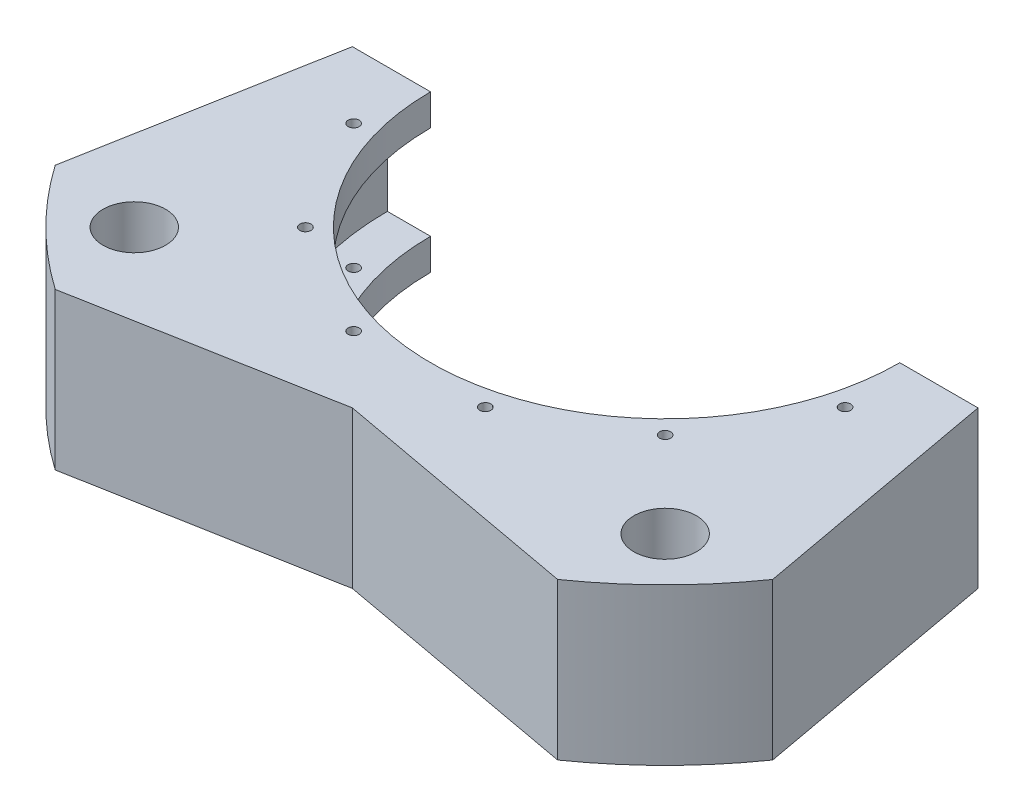
ISO-10303-21;
HEADER;
FILE_DESCRIPTION(('STEP AP214'),'2;1');
FILE_NAME('part.step','',(''),(''),'','','');
FILE_SCHEMA(('AUTOMOTIVE_DESIGN { 1 0 10303 214 1 1 1 1 }'));
ENDSEC;
DATA;
#1=APPLICATION_CONTEXT('core data for automotive mechanical design processes');
#2=APPLICATION_PROTOCOL_DEFINITION('international standard','automotive_design',2000,#1);
#3=PRODUCT_CONTEXT('',#1,'mechanical');
#4=PRODUCT('Part','Part','',(#3));
#5=PRODUCT_RELATED_PRODUCT_CATEGORY('part','',(#4));
#6=PRODUCT_DEFINITION_FORMATION('','',#4);
#7=PRODUCT_DEFINITION_CONTEXT('part definition',#1,'design');
#8=PRODUCT_DEFINITION('design','',#6,#7);
#9=PRODUCT_DEFINITION_SHAPE('','',#8);
#10=(LENGTH_UNIT() NAMED_UNIT(*) SI_UNIT(.MILLI.,.METRE.));
#11=(NAMED_UNIT(*) PLANE_ANGLE_UNIT() SI_UNIT($,.RADIAN.));
#12=(NAMED_UNIT(*) SI_UNIT($,.STERADIAN.) SOLID_ANGLE_UNIT());
#13=UNCERTAINTY_MEASURE_WITH_UNIT(LENGTH_MEASURE(1.E-05),#10,'distance_accuracy_value','');
#14=(GEOMETRIC_REPRESENTATION_CONTEXT(3) GLOBAL_UNCERTAINTY_ASSIGNED_CONTEXT((#13)) GLOBAL_UNIT_ASSIGNED_CONTEXT((#10,
#11,#12)) REPRESENTATION_CONTEXT('',''));
#15=CARTESIAN_POINT('',(0.,0.,0.));
#16=DIRECTION('',(0.,0.,1.));
#17=DIRECTION('',(1.,0.,0.));
#18=AXIS2_PLACEMENT_3D('',#15,#16,#17);
#19=CARTESIAN_POINT('',(0.,22.5392867230028,0.));
#20=DIRECTION('',(0.,1.,0.));
#21=DIRECTION('',(0.,0.,1.));
#22=AXIS2_PLACEMENT_3D('',#19,#20,#21);
#23=CYLINDRICAL_SURFACE('',#22,88.9);
#24=CARTESIAN_POINT('',(0.,15.875,0.));
#25=DIRECTION('',(0.,1.,0.));
#26=DIRECTION('',(0.,0.,1.));
#27=AXIS2_PLACEMENT_3D('',#24,#25,#26);
#28=CIRCLE('',#27,88.9);
#29=CARTESIAN_POINT('',(50.9909451916081,15.875,72.8226167372913));
#30=VERTEX_POINT('',#29);
#31=CARTESIAN_POINT('',(72.8226167372913,15.875,50.9909451916081));
#32=VERTEX_POINT('',#31);
#33=EDGE_CURVE('E159',#30,#32,#28,.T.);
#34=ORIENTED_EDGE('',*,*,#33,.F.);
#35=DIRECTION('',(0.,1.,0.));
#36=VECTOR('',#35,1.);
#37=CARTESIAN_POINT('',(50.9909451916081,-15.876,72.8226167372913));
#38=LINE('',#37,#36);
#39=CARTESIAN_POINT('',(50.9909451916081,-15.875,72.8226167372913));
#40=VERTEX_POINT('',#39);
#41=EDGE_CURVE('E154',#40,#30,#38,.T.);
#42=ORIENTED_EDGE('',*,*,#41,.F.);
#43=CARTESIAN_POINT('',(0.,-15.875,0.));
#44=DIRECTION('',(0.,1.,0.));
#45=DIRECTION('',(0.,0.,1.));
#46=AXIS2_PLACEMENT_3D('',#43,#44,#45);
#47=CIRCLE('',#46,88.9);
#48=CARTESIAN_POINT('',(72.8226167372913,-15.875,50.9909451916081));
#49=VERTEX_POINT('',#48);
#50=EDGE_CURVE('E148',#40,#49,#47,.T.);
#51=ORIENTED_EDGE('',*,*,#50,.T.);
#52=DIRECTION('',(0.,1.,0.));
#53=VECTOR('',#52,1.);
#54=CARTESIAN_POINT('',(72.8226167372913,-15.876,50.9909451916081));
#55=LINE('',#54,#53);
#56=EDGE_CURVE('E130',#49,#32,#55,.T.);
#57=ORIENTED_EDGE('',*,*,#56,.T.);
#58=EDGE_LOOP('',(#34,#42,#51,#57));
#59=FACE_BOUND('',#58,.T.);
#60=ADVANCED_FACE('F33',(#59),#23,.T.);
#61=CARTESIAN_POINT('',(-72.8226167372913,-15.875,50.9909451916081));
#62=VERTEX_POINT('',#61);
#63=CARTESIAN_POINT('',(-50.9909451916081,-15.875,72.8226167372913));
#64=VERTEX_POINT('',#63);
#65=EDGE_CURVE('E155',#62,#64,#47,.T.);
#66=ORIENTED_EDGE('',*,*,#65,.T.);
#67=DIRECTION('',(0.,1.,0.));
#68=VECTOR('',#67,1.);
#69=CARTESIAN_POINT('',(-50.9909451916081,-15.876,72.8226167372913));
#70=LINE('',#69,#68);
#71=CARTESIAN_POINT('',(-50.9909451916081,15.875,72.8226167372913));
#72=VERTEX_POINT('',#71);
#73=EDGE_CURVE('E50',#64,#72,#70,.T.);
#74=ORIENTED_EDGE('',*,*,#73,.T.);
#75=CARTESIAN_POINT('',(-72.8226167372913,15.875,50.9909451916081));
#76=VERTEX_POINT('',#75);
#77=EDGE_CURVE('E165',#76,#72,#28,.T.);
#78=ORIENTED_EDGE('',*,*,#77,.F.);
#79=DIRECTION('',(0.,1.,0.));
#80=VECTOR('',#79,1.);
#81=CARTESIAN_POINT('',(-72.8226167372913,-15.876,50.9909451916081));
#82=LINE('',#81,#80);
#83=EDGE_CURVE('E293',#62,#76,#82,.T.);
#84=ORIENTED_EDGE('',*,*,#83,.F.);
#85=EDGE_LOOP('',(#66,#74,#78,#84));
#86=FACE_BOUND('',#85,.T.);
#87=ADVANCED_FACE('F350',(#86),#23,.T.);
#88=CARTESIAN_POINT('',(-47.625,15.875,-3.32563597524808E-13));
#89=DIRECTION('',(0.,-1.,0.));
#90=DIRECTION('',(0.,0.,-1.));
#91=AXIS2_PLACEMENT_3D('',#88,#89,#90);
#92=PLANE('',#91);
#93=CARTESIAN_POINT('',(-53.8815367264144,15.875,53.8815367264146));
#94=DIRECTION('',(0.,1.,0.));
#95=DIRECTION('',(0.,0.,1.));
#96=AXIS2_PLACEMENT_3D('',#93,#94,#95);
#97=CIRCLE('',#96,6.35000000000001);
#98=CARTESIAN_POINT('',(-53.8815367264144,15.875,60.2315367264146));
#99=VERTEX_POINT('',#98);
#100=EDGE_CURVE('E298',#99,#99,#97,.T.);
#101=ORIENTED_EDGE('',*,*,#100,.F.);
#102=EDGE_LOOP('',(#101));
#103=FACE_BOUND('',#102,.T.);
#104=CARTESIAN_POINT('',(49.8786710030803,15.875,13.3649496148126));
#105=DIRECTION('',(0.,1.,0.));
#106=DIRECTION('',(0.,0.,1.));
#107=AXIS2_PLACEMENT_3D('',#104,#105,#106);
#108=CIRCLE('',#107,1.13029999999999);
#109=CARTESIAN_POINT('',(49.8786710030803,15.875,14.4952496148126));
#110=VERTEX_POINT('',#109);
#111=EDGE_CURVE('E228',#110,#110,#108,.T.);
#112=ORIENTED_EDGE('',*,*,#111,.F.);
#113=EDGE_LOOP('',(#112));
#114=FACE_BOUND('',#113,.T.);
#115=CARTESIAN_POINT('',(-49.87867100308,15.875,13.3649496148137));
#116=DIRECTION('',(0.,1.,0.));
#117=DIRECTION('',(0.,0.,1.));
#118=AXIS2_PLACEMENT_3D('',#115,#116,#117);
#119=CIRCLE('',#118,1.13029999999999);
#120=CARTESIAN_POINT('',(-49.87867100308,15.875,14.4952496148137));
#121=VERTEX_POINT('',#120);
#122=EDGE_CURVE('E216',#121,#121,#119,.T.);
#123=ORIENTED_EDGE('',*,*,#122,.F.);
#124=EDGE_LOOP('',(#123));
#125=FACE_BOUND('',#124,.T.);
#126=CARTESIAN_POINT('',(-36.5137213882666,15.875,36.5137213882678));
#127=DIRECTION('',(0.,1.,0.));
#128=DIRECTION('',(0.,0.,1.));
#129=AXIS2_PLACEMENT_3D('',#126,#127,#128);
#130=CIRCLE('',#129,1.13029999999999);
#131=CARTESIAN_POINT('',(-36.5137213882666,15.875,37.6440213882678));
#132=VERTEX_POINT('',#131);
#133=EDGE_CURVE('E209',#132,#132,#130,.T.);
#134=ORIENTED_EDGE('',*,*,#133,.F.);
#135=EDGE_LOOP('',(#134));
#136=FACE_BOUND('',#135,.T.);
#137=CARTESIAN_POINT('',(-13.3649496148121,15.875,49.8786710030804));
#138=DIRECTION('',(0.,1.,0.));
#139=DIRECTION('',(0.,0.,1.));
#140=AXIS2_PLACEMENT_3D('',#137,#138,#139);
#141=CIRCLE('',#140,1.13029999999999);
#142=CARTESIAN_POINT('',(-13.3649496148121,15.875,51.0089710030804));
#143=VERTEX_POINT('',#142);
#144=EDGE_CURVE('E186',#143,#143,#141,.T.);
#145=ORIENTED_EDGE('',*,*,#144,.F.);
#146=EDGE_LOOP('',(#145));
#147=FACE_BOUND('',#146,.T.);
#148=CARTESIAN_POINT('',(13.3649496148139,15.875,49.8786710030799));
#149=DIRECTION('',(0.,1.,0.));
#150=DIRECTION('',(0.,0.,1.));
#151=AXIS2_PLACEMENT_3D('',#148,#149,#150);
#152=CIRCLE('',#151,1.13029999999999);
#153=CARTESIAN_POINT('',(13.3649496148139,15.875,51.0089710030799));
#154=VERTEX_POINT('',#153);
#155=EDGE_CURVE('E189',#154,#154,#152,.T.);
#156=ORIENTED_EDGE('',*,*,#155,.F.);
#157=EDGE_LOOP('',(#156));
#158=FACE_BOUND('',#157,.T.);
#159=CARTESIAN_POINT('',(36.5137213882679,15.875,36.5137213882665));
#160=DIRECTION('',(0.,1.,0.));
#161=DIRECTION('',(0.,0.,1.));
#162=AXIS2_PLACEMENT_3D('',#159,#160,#161);
#163=CIRCLE('',#162,1.13029999999999);
#164=CARTESIAN_POINT('',(36.5137213882679,15.875,37.6440213882664));
#165=VERTEX_POINT('',#164);
#166=EDGE_CURVE('E320',#165,#165,#163,.T.);
#167=ORIENTED_EDGE('',*,*,#166,.F.);
#168=EDGE_LOOP('',(#167));
#169=FACE_BOUND('',#168,.T.);
#170=CARTESIAN_POINT('',(53.8815367264152,15.875,53.8815367264146));
#171=DIRECTION('',(0.,1.,0.));
#172=DIRECTION('',(0.,0.,1.));
#173=AXIS2_PLACEMENT_3D('',#170,#171,#172);
#174=CIRCLE('',#173,6.35);
#175=CARTESIAN_POINT('',(53.8815367264152,15.875,60.2315367264146));
#176=VERTEX_POINT('',#175);
#177=EDGE_CURVE('E304',#176,#176,#174,.T.);
#178=ORIENTED_EDGE('',*,*,#177,.F.);
#179=EDGE_LOOP('',(#178));
#180=FACE_BOUND('',#179,.T.);
#181=DIRECTION('',(-0.983694459254473,0.,0.179847743472221));
#182=VECTOR('',#181,1.);
#183=CARTESIAN_POINT('',(11.2341170264533,15.875,61.4460791121649));
#184=LINE('',#183,#182);
#185=CARTESIAN_POINT('',(3.50414142147315E-13,15.875,63.5));
#186=VERTEX_POINT('',#185);
#187=EDGE_CURVE('E308',#186,#72,#184,.T.);
#188=ORIENTED_EDGE('',*,*,#187,.F.);
#189=DIRECTION('',(-0.983694459254473,0.,-0.179847743472223));
#190=VECTOR('',#189,1.);
#191=CARTESIAN_POINT('',(-11.2341170264534,15.875,61.4460791121647));
#192=LINE('',#191,#190);
#193=EDGE_CURVE('E288',#30,#186,#192,.T.);
#194=ORIENTED_EDGE('',*,*,#193,.F.);
#195=ORIENTED_EDGE('',*,*,#33,.T.);
#196=DIRECTION('',(-0.17984774347222,0.,-0.983694459254473));
#197=VECTOR('',#196,1.);
#198=CARTESIAN_POINT('',(61.446079112165,15.875,-11.2341170264532));
#199=LINE('',#198,#197);
#200=CARTESIAN_POINT('',(63.5000000000001,15.875,0.));
#201=VERTEX_POINT('',#200);
#202=EDGE_CURVE('E136',#32,#201,#199,.T.);
#203=ORIENTED_EDGE('',*,*,#202,.T.);
#204=DIRECTION('',(-1.,0.,0.));
#205=VECTOR('',#204,1.);
#206=CARTESIAN_POINT('',(47.625,15.875,0.));
#207=LINE('',#206,#205);
#208=CARTESIAN_POINT('',(47.625,15.875,0.));
#209=VERTEX_POINT('',#208);
#210=EDGE_CURVE('E245',#201,#209,#207,.T.);
#211=ORIENTED_EDGE('',*,*,#210,.T.);
#212=CARTESIAN_POINT('',(0.,15.875,0.));
#213=DIRECTION('',(0.,1.,0.));
#214=DIRECTION('',(0.,0.,1.));
#215=AXIS2_PLACEMENT_3D('',#212,#213,#214);
#216=CIRCLE('',#215,47.625);
#217=CARTESIAN_POINT('',(-47.625,15.875,-3.32563597524808E-13));
#218=VERTEX_POINT('',#217);
#219=EDGE_CURVE('E166',#218,#209,#216,.T.);
#220=ORIENTED_EDGE('',*,*,#219,.F.);
#221=DIRECTION('',(1.,0.,0.));
#222=VECTOR('',#221,1.);
#223=CARTESIAN_POINT('',(-47.625,15.875,-3.32563597524808E-13));
#224=LINE('',#223,#222);
#225=CARTESIAN_POINT('',(-63.5,15.875,-4.43418130033078E-13));
#226=VERTEX_POINT('',#225);
#227=EDGE_CURVE('E265',#226,#218,#224,.T.);
#228=ORIENTED_EDGE('',*,*,#227,.F.);
#229=DIRECTION('',(0.179847743472219,0.,-0.983694459254473));
#230=VECTOR('',#229,1.);
#231=CARTESIAN_POINT('',(-61.446079112165,15.875,-11.2341170264532));
#232=LINE('',#231,#230);
#233=EDGE_CURVE('E58',#76,#226,#232,.T.);
#234=ORIENTED_EDGE('',*,*,#233,.F.);
#235=ORIENTED_EDGE('',*,*,#77,.T.);
#236=EDGE_LOOP('',(#188,#194,#195,#203,#211,#220,#228,#234,#235));
#237=FACE_BOUND('',#236,.T.);
#238=ADVANCED_FACE('F355',(#103,#114,#125,#136,#147,#158,#169,#180,#237),#92,.F.);
#239=CARTESIAN_POINT('',(-47.625,-15.875,-3.32563597524809E-13));
#240=DIRECTION('',(0.,1.,0.));
#241=DIRECTION('',(0.,0.,1.));
#242=AXIS2_PLACEMENT_3D('',#239,#240,#241);
#243=PLANE('',#242);
#244=CARTESIAN_POINT('',(-53.8815367264144,-15.875,53.8815367264146));
#245=DIRECTION('',(0.,1.,0.));
#246=DIRECTION('',(0.,0.,1.));
#247=AXIS2_PLACEMENT_3D('',#244,#245,#246);
#248=CIRCLE('',#247,6.35000000000001);
#249=CARTESIAN_POINT('',(-53.8815367264144,-15.875,60.2315367264146));
#250=VERTEX_POINT('',#249);
#251=EDGE_CURVE('E301',#250,#250,#248,.F.);
#252=ORIENTED_EDGE('',*,*,#251,.F.);
#253=EDGE_LOOP('',(#252));
#254=FACE_BOUND('',#253,.T.);
#255=CARTESIAN_POINT('',(49.8786710030803,-15.875,13.3649496148126));
#256=DIRECTION('',(0.,1.,0.));
#257=DIRECTION('',(0.,0.,1.));
#258=AXIS2_PLACEMENT_3D('',#255,#256,#257);
#259=CIRCLE('',#258,1.13029999999999);
#260=CARTESIAN_POINT('',(49.8786710030803,-15.875,14.4952496148126));
#261=VERTEX_POINT('',#260);
#262=EDGE_CURVE('E174',#261,#261,#259,.T.);
#263=ORIENTED_EDGE('',*,*,#262,.T.);
#264=EDGE_LOOP('',(#263));
#265=FACE_BOUND('',#264,.T.);
#266=CARTESIAN_POINT('',(-49.87867100308,-15.875,13.3649496148137));
#267=DIRECTION('',(0.,1.,0.));
#268=DIRECTION('',(0.,0.,1.));
#269=AXIS2_PLACEMENT_3D('',#266,#267,#268);
#270=CIRCLE('',#269,1.13029999999999);
#271=CARTESIAN_POINT('',(-49.87867100308,-15.875,14.4952496148137));
#272=VERTEX_POINT('',#271);
#273=EDGE_CURVE('E219',#272,#272,#270,.T.);
#274=ORIENTED_EDGE('',*,*,#273,.T.);
#275=EDGE_LOOP('',(#274));
#276=FACE_BOUND('',#275,.T.);
#277=CARTESIAN_POINT('',(-36.5137213882666,-15.875,36.5137213882678));
#278=DIRECTION('',(0.,1.,0.));
#279=DIRECTION('',(0.,0.,1.));
#280=AXIS2_PLACEMENT_3D('',#277,#278,#279);
#281=CIRCLE('',#280,1.13029999999999);
#282=CARTESIAN_POINT('',(-36.5137213882666,-15.875,37.6440213882678));
#283=VERTEX_POINT('',#282);
#284=EDGE_CURVE('E178',#283,#283,#281,.T.);
#285=ORIENTED_EDGE('',*,*,#284,.T.);
#286=EDGE_LOOP('',(#285));
#287=FACE_BOUND('',#286,.T.);
#288=CARTESIAN_POINT('',(-13.3649496148121,-15.875,49.8786710030804));
#289=DIRECTION('',(0.,1.,0.));
#290=DIRECTION('',(0.,0.,1.));
#291=AXIS2_PLACEMENT_3D('',#288,#289,#290);
#292=CIRCLE('',#291,1.1303);
#293=CARTESIAN_POINT('',(-13.3649496148121,-15.875,51.0089710030804));
#294=VERTEX_POINT('',#293);
#295=EDGE_CURVE('E200',#294,#294,#292,.T.);
#296=ORIENTED_EDGE('',*,*,#295,.T.);
#297=EDGE_LOOP('',(#296));
#298=FACE_BOUND('',#297,.T.);
#299=CARTESIAN_POINT('',(13.3649496148139,-15.875,49.8786710030799));
#300=DIRECTION('',(0.,1.,0.));
#301=DIRECTION('',(0.,0.,1.));
#302=AXIS2_PLACEMENT_3D('',#299,#300,#301);
#303=CIRCLE('',#302,1.1303);
#304=CARTESIAN_POINT('',(13.3649496148139,-15.875,51.0089710030799));
#305=VERTEX_POINT('',#304);
#306=EDGE_CURVE('E182',#305,#305,#303,.T.);
#307=ORIENTED_EDGE('',*,*,#306,.T.);
#308=EDGE_LOOP('',(#307));
#309=FACE_BOUND('',#308,.T.);
#310=CARTESIAN_POINT('',(36.5137213882679,-15.875,36.5137213882665));
#311=DIRECTION('',(0.,1.,0.));
#312=DIRECTION('',(0.,0.,1.));
#313=AXIS2_PLACEMENT_3D('',#310,#311,#312);
#314=CIRCLE('',#313,1.13029999999999);
#315=CARTESIAN_POINT('',(36.5137213882679,-15.875,37.6440213882665));
#316=VERTEX_POINT('',#315);
#317=EDGE_CURVE('E323',#316,#316,#314,.T.);
#318=ORIENTED_EDGE('',*,*,#317,.T.);
#319=EDGE_LOOP('',(#318));
#320=FACE_BOUND('',#319,.T.);
#321=CARTESIAN_POINT('',(53.8815367264152,-15.875,53.8815367264146));
#322=DIRECTION('',(0.,1.,0.));
#323=DIRECTION('',(0.,0.,1.));
#324=AXIS2_PLACEMENT_3D('',#321,#322,#323);
#325=CIRCLE('',#324,6.35);
#326=CARTESIAN_POINT('',(53.8815367264152,-15.875,60.2315367264146));
#327=VERTEX_POINT('',#326);
#328=EDGE_CURVE('E317',#327,#327,#325,.F.);
#329=ORIENTED_EDGE('',*,*,#328,.F.);
#330=EDGE_LOOP('',(#329));
#331=FACE_BOUND('',#330,.T.);
#332=ORIENTED_EDGE('',*,*,#50,.F.);
#333=DIRECTION('',(0.983694459254473,0.,0.179847743472223));
#334=VECTOR('',#333,1.);
#335=CARTESIAN_POINT('',(-11.2341170264534,-15.875,61.4460791121647));
#336=LINE('',#335,#334);
#337=CARTESIAN_POINT('',(3.50414142147315E-13,-15.875,63.5));
#338=VERTEX_POINT('',#337);
#339=EDGE_CURVE('E286',#338,#40,#336,.T.);
#340=ORIENTED_EDGE('',*,*,#339,.F.);
#341=DIRECTION('',(0.983694459254473,0.,-0.179847743472221));
#342=VECTOR('',#341,1.);
#343=CARTESIAN_POINT('',(11.2341170264533,-15.875,61.4460791121649));
#344=LINE('',#343,#342);
#345=EDGE_CURVE('E302',#64,#338,#344,.T.);
#346=ORIENTED_EDGE('',*,*,#345,.F.);
#347=ORIENTED_EDGE('',*,*,#65,.F.);
#348=DIRECTION('',(-0.179847743472219,0.,0.983694459254474));
#349=VECTOR('',#348,1.);
#350=CARTESIAN_POINT('',(-61.446079112165,-15.875,-11.2341170264532));
#351=LINE('',#350,#349);
#352=CARTESIAN_POINT('',(-63.5,-15.875,-4.42886308203582E-13));
#353=VERTEX_POINT('',#352);
#354=EDGE_CURVE('E151',#353,#62,#351,.T.);
#355=ORIENTED_EDGE('',*,*,#354,.F.);
#356=DIRECTION('',(-1.,0.,0.));
#357=VECTOR('',#356,1.);
#358=CARTESIAN_POINT('',(-47.625,-15.875,-3.32563597524809E-13));
#359=LINE('',#358,#357);
#360=CARTESIAN_POINT('',(-47.625,-15.875,-3.32563597524809E-13));
#361=VERTEX_POINT('',#360);
#362=EDGE_CURVE('E262',#361,#353,#359,.T.);
#363=ORIENTED_EDGE('',*,*,#362,.F.);
#364=CARTESIAN_POINT('',(0.,-15.875,0.));
#365=DIRECTION('',(0.,1.,0.));
#366=DIRECTION('',(0.,0.,1.));
#367=AXIS2_PLACEMENT_3D('',#364,#365,#366);
#368=CIRCLE('',#367,47.625);
#369=CARTESIAN_POINT('',(47.625,-15.875,0.));
#370=VERTEX_POINT('',#369);
#371=EDGE_CURVE('E156',#361,#370,#368,.T.);
#372=ORIENTED_EDGE('',*,*,#371,.T.);
#373=DIRECTION('',(1.,0.,0.));
#374=VECTOR('',#373,1.);
#375=CARTESIAN_POINT('',(47.625,-15.875,0.));
#376=LINE('',#375,#374);
#377=CARTESIAN_POINT('',(63.5000000000001,-15.875,0.));
#378=VERTEX_POINT('',#377);
#379=EDGE_CURVE('E150',#370,#378,#376,.T.);
#380=ORIENTED_EDGE('',*,*,#379,.T.);
#381=DIRECTION('',(0.17984774347222,0.,0.983694459254473));
#382=VECTOR('',#381,1.);
#383=CARTESIAN_POINT('',(61.446079112165,-15.875,-11.2341170264532));
#384=LINE('',#383,#382);
#385=EDGE_CURVE('E133',#378,#49,#384,.T.);
#386=ORIENTED_EDGE('',*,*,#385,.T.);
#387=EDGE_LOOP('',(#332,#340,#346,#347,#355,#363,#372,#380,#386));
#388=FACE_BOUND('',#387,.T.);
#389=ADVANCED_FACE('F146',(#254,#265,#276,#287,#298,#309,#320,#331,#388),#243,.F.);
#390=CARTESIAN_POINT('',(0.,0.,0.));
#391=DIRECTION('',(0.,0.,-1.));
#392=DIRECTION('',(-1.,0.,0.));
#393=AXIS2_PLACEMENT_3D('',#390,#391,#392);
#394=PLANE('',#393);
#395=ORIENTED_EDGE('',*,*,#210,.F.);
#396=DIRECTION('',(0.,1.,0.));
#397=VECTOR('',#396,1.);
#398=CARTESIAN_POINT('',(63.5000000000001,-15.876,0.));
#399=LINE('',#398,#397);
#400=EDGE_CURVE('E141',#378,#201,#399,.T.);
#401=ORIENTED_EDGE('',*,*,#400,.F.);
#402=ORIENTED_EDGE('',*,*,#379,.F.);
#403=DIRECTION('',(0.,-1.,0.));
#404=VECTOR('',#403,1.);
#405=CARTESIAN_POINT('',(47.625,-9.525,0.));
#406=LINE('',#405,#404);
#407=CARTESIAN_POINT('',(47.625,-9.525,0.));
#408=VERTEX_POINT('',#407);
#409=EDGE_CURVE('E241',#408,#370,#406,.T.);
#410=ORIENTED_EDGE('',*,*,#409,.F.);
#411=DIRECTION('',(-1.,0.,0.));
#412=VECTOR('',#411,1.);
#413=CARTESIAN_POINT('',(56.388,-9.525,0.));
#414=LINE('',#413,#412);
#415=CARTESIAN_POINT('',(56.388,-9.525,0.));
#416=VERTEX_POINT('',#415);
#417=EDGE_CURVE('E238',#416,#408,#414,.T.);
#418=ORIENTED_EDGE('',*,*,#417,.F.);
#419=DIRECTION('',(0.,-1.,0.));
#420=VECTOR('',#419,1.);
#421=CARTESIAN_POINT('',(56.388,0.,0.));
#422=LINE('',#421,#420);
#423=CARTESIAN_POINT('',(56.388,9.525,0.));
#424=VERTEX_POINT('',#423);
#425=EDGE_CURVE('E235',#424,#416,#422,.T.);
#426=ORIENTED_EDGE('',*,*,#425,.F.);
#427=DIRECTION('',(1.,0.,0.));
#428=VECTOR('',#427,1.);
#429=CARTESIAN_POINT('',(56.388,9.525,0.));
#430=LINE('',#429,#428);
#431=CARTESIAN_POINT('',(47.625,9.525,0.));
#432=VERTEX_POINT('',#431);
#433=EDGE_CURVE('E250',#432,#424,#430,.T.);
#434=ORIENTED_EDGE('',*,*,#433,.F.);
#435=DIRECTION('',(0.,-1.,0.));
#436=VECTOR('',#435,1.);
#437=CARTESIAN_POINT('',(47.625,9.525,0.));
#438=LINE('',#437,#436);
#439=EDGE_CURVE('E247',#209,#432,#438,.T.);
#440=ORIENTED_EDGE('',*,*,#439,.F.);
#441=EDGE_LOOP('',(#395,#401,#402,#410,#418,#426,#434,#440));
#442=FACE_BOUND('',#441,.T.);
#443=ADVANCED_FACE('F284',(#442),#394,.T.);
#444=CARTESIAN_POINT('',(0.,22.5392867230028,0.));
#445=DIRECTION('',(0.,1.,0.));
#446=DIRECTION('',(0.,0.,1.));
#447=AXIS2_PLACEMENT_3D('',#444,#445,#446);
#448=CYLINDRICAL_SURFACE('',#447,56.388);
#449=CARTESIAN_POINT('',(0.,9.525,0.));
#450=DIRECTION('',(0.,1.,0.));
#451=DIRECTION('',(0.,0.,1.));
#452=AXIS2_PLACEMENT_3D('',#449,#450,#451);
#453=CIRCLE('',#452,56.388);
#454=CARTESIAN_POINT('',(-56.388,9.525,-3.93755299469373E-13));
#455=VERTEX_POINT('',#454);
#456=EDGE_CURVE('E11',#455,#424,#453,.T.);
#457=ORIENTED_EDGE('',*,*,#456,.T.);
#458=ORIENTED_EDGE('',*,*,#425,.T.);
#459=CARTESIAN_POINT('',(0.,-9.525,0.));
#460=DIRECTION('',(0.,1.,0.));
#461=DIRECTION('',(0.,0.,1.));
#462=AXIS2_PLACEMENT_3D('',#459,#460,#461);
#463=CIRCLE('',#462,56.388);
#464=CARTESIAN_POINT('',(-56.388,-9.525,-3.93755299469373E-13));
#465=VERTEX_POINT('',#464);
#466=EDGE_CURVE('E273',#465,#416,#463,.T.);
#467=ORIENTED_EDGE('',*,*,#466,.F.);
#468=DIRECTION('',(0.,-1.,0.));
#469=VECTOR('',#468,1.);
#470=CARTESIAN_POINT('',(-56.388,0.,-3.93755299469373E-13));
#471=LINE('',#470,#469);
#472=EDGE_CURVE('E253',#455,#465,#471,.T.);
#473=ORIENTED_EDGE('',*,*,#472,.F.);
#474=EDGE_LOOP('',(#457,#458,#467,#473));
#475=FACE_BOUND('',#474,.T.);
#476=ADVANCED_FACE('F35',(#475),#448,.F.);
#477=CARTESIAN_POINT('',(-56.388,9.525,-3.93755299469373E-13));
#478=DIRECTION('',(0.,1.,0.));
#479=DIRECTION('',(0.,0.,1.));
#480=AXIS2_PLACEMENT_3D('',#477,#478,#479);
#481=PLANE('',#480);
#482=CARTESIAN_POINT('',(36.5137213882679,9.525,36.5137213882665));
#483=DIRECTION('',(0.,1.,0.));
#484=DIRECTION('',(0.,0.,1.));
#485=AXIS2_PLACEMENT_3D('',#482,#483,#484);
#486=CIRCLE('',#485,1.13029999999999);
#487=CARTESIAN_POINT('',(36.5137213882679,9.525,37.6440213882664));
#488=VERTEX_POINT('',#487);
#489=EDGE_CURVE('E37',#488,#488,#486,.T.);
#490=ORIENTED_EDGE('',*,*,#489,.T.);
#491=EDGE_LOOP('',(#490));
#492=FACE_BOUND('',#491,.T.);
#493=CARTESIAN_POINT('',(13.3649496148139,9.525,49.8786710030799));
#494=DIRECTION('',(0.,1.,0.));
#495=DIRECTION('',(0.,0.,1.));
#496=AXIS2_PLACEMENT_3D('',#493,#494,#495);
#497=CIRCLE('',#496,1.13029999999999);
#498=CARTESIAN_POINT('',(13.3649496148139,9.525,51.0089710030799));
#499=VERTEX_POINT('',#498);
#500=EDGE_CURVE('E181',#499,#499,#497,.T.);
#501=ORIENTED_EDGE('',*,*,#500,.T.);
#502=EDGE_LOOP('',(#501));
#503=FACE_BOUND('',#502,.T.);
#504=CARTESIAN_POINT('',(-13.3649496148121,9.525,49.8786710030804));
#505=DIRECTION('',(0.,1.,0.));
#506=DIRECTION('',(0.,0.,1.));
#507=AXIS2_PLACEMENT_3D('',#504,#505,#506);
#508=CIRCLE('',#507,1.13029999999999);
#509=CARTESIAN_POINT('',(-13.3649496148121,9.525,51.0089710030804));
#510=VERTEX_POINT('',#509);
#511=EDGE_CURVE('E206',#510,#510,#508,.T.);
#512=ORIENTED_EDGE('',*,*,#511,.T.);
#513=EDGE_LOOP('',(#512));
#514=FACE_BOUND('',#513,.T.);
#515=CARTESIAN_POINT('',(-36.5137213882666,9.525,36.5137213882678));
#516=DIRECTION('',(0.,1.,0.));
#517=DIRECTION('',(0.,0.,1.));
#518=AXIS2_PLACEMENT_3D('',#515,#516,#517);
#519=CIRCLE('',#518,1.13029999999999);
#520=CARTESIAN_POINT('',(-36.5137213882666,9.525,37.6440213882678));
#521=VERTEX_POINT('',#520);
#522=EDGE_CURVE('E175',#521,#521,#519,.T.);
#523=ORIENTED_EDGE('',*,*,#522,.T.);
#524=EDGE_LOOP('',(#523));
#525=FACE_BOUND('',#524,.T.);
#526=CARTESIAN_POINT('',(-49.87867100308,9.525,13.3649496148137));
#527=DIRECTION('',(0.,1.,0.));
#528=DIRECTION('',(0.,0.,1.));
#529=AXIS2_PLACEMENT_3D('',#526,#527,#528);
#530=CIRCLE('',#529,1.13029999999999);
#531=CARTESIAN_POINT('',(-49.87867100308,9.525,14.4952496148137));
#532=VERTEX_POINT('',#531);
#533=EDGE_CURVE('E222',#532,#532,#530,.T.);
#534=ORIENTED_EDGE('',*,*,#533,.T.);
#535=EDGE_LOOP('',(#534));
#536=FACE_BOUND('',#535,.T.);
#537=CARTESIAN_POINT('',(49.8786710030803,9.525,13.3649496148126));
#538=DIRECTION('',(0.,1.,0.));
#539=DIRECTION('',(0.,0.,1.));
#540=AXIS2_PLACEMENT_3D('',#537,#538,#539);
#541=CIRCLE('',#540,1.13029999999999);
#542=CARTESIAN_POINT('',(49.8786710030803,9.525,14.4952496148126));
#543=VERTEX_POINT('',#542);
#544=EDGE_CURVE('E170',#543,#543,#541,.T.);
#545=ORIENTED_EDGE('',*,*,#544,.T.);
#546=EDGE_LOOP('',(#545));
#547=FACE_BOUND('',#546,.T.);
#548=CARTESIAN_POINT('',(0.,9.525,0.));
#549=DIRECTION('',(0.,1.,0.));
#550=DIRECTION('',(0.,0.,1.));
#551=AXIS2_PLACEMENT_3D('',#548,#549,#550);
#552=CIRCLE('',#551,47.625);
#553=CARTESIAN_POINT('',(-47.625,9.525,-3.32563597524808E-13));
#554=VERTEX_POINT('',#553);
#555=EDGE_CURVE('E42',#554,#432,#552,.T.);
#556=ORIENTED_EDGE('',*,*,#555,.T.);
#557=ORIENTED_EDGE('',*,*,#433,.T.);
#558=ORIENTED_EDGE('',*,*,#456,.F.);
#559=DIRECTION('',(-1.,0.,0.));
#560=VECTOR('',#559,1.);
#561=CARTESIAN_POINT('',(-56.388,9.525,-3.93755299469373E-13));
#562=LINE('',#561,#560);
#563=EDGE_CURVE('E270',#554,#455,#562,.T.);
#564=ORIENTED_EDGE('',*,*,#563,.F.);
#565=EDGE_LOOP('',(#556,#557,#558,#564));
#566=FACE_BOUND('',#565,.T.);
#567=ADVANCED_FACE('F331',(#492,#503,#514,#525,#536,#547,#566),#481,.F.);
#568=CARTESIAN_POINT('',(0.,22.5392867230028,0.));
#569=DIRECTION('',(0.,1.,0.));
#570=DIRECTION('',(0.,0.,1.));
#571=AXIS2_PLACEMENT_3D('',#568,#569,#570);
#572=CYLINDRICAL_SURFACE('',#571,47.625);
#573=ORIENTED_EDGE('',*,*,#219,.T.);
#574=ORIENTED_EDGE('',*,*,#439,.T.);
#575=ORIENTED_EDGE('',*,*,#555,.F.);
#576=DIRECTION('',(0.,-1.,0.));
#577=VECTOR('',#576,1.);
#578=CARTESIAN_POINT('',(-47.625,9.525,-3.32563597524808E-13));
#579=LINE('',#578,#577);
#580=EDGE_CURVE('E267',#218,#554,#579,.T.);
#581=ORIENTED_EDGE('',*,*,#580,.F.);
#582=EDGE_LOOP('',(#573,#574,#575,#581));
#583=FACE_BOUND('',#582,.T.);
#584=ADVANCED_FACE('F363',(#583),#572,.F.);
#585=CARTESIAN_POINT('',(0.,22.5392867230028,0.));
#586=DIRECTION('',(0.,1.,0.));
#587=DIRECTION('',(0.,0.,1.));
#588=AXIS2_PLACEMENT_3D('',#585,#586,#587);
#589=CYLINDRICAL_SURFACE('',#588,47.625);
#590=CARTESIAN_POINT('',(0.,-9.52500000000001,0.));
#591=DIRECTION('',(0.,1.,0.));
#592=DIRECTION('',(0.,0.,1.));
#593=AXIS2_PLACEMENT_3D('',#590,#591,#592);
#594=CIRCLE('',#593,47.625);
#595=CARTESIAN_POINT('',(-47.625,-9.525,-3.32563597524808E-13));
#596=VERTEX_POINT('',#595);
#597=EDGE_CURVE('E160',#596,#408,#594,.T.);
#598=ORIENTED_EDGE('',*,*,#597,.T.);
#599=ORIENTED_EDGE('',*,*,#409,.T.);
#600=ORIENTED_EDGE('',*,*,#371,.F.);
#601=DIRECTION('',(0.,-1.,0.));
#602=VECTOR('',#601,1.);
#603=CARTESIAN_POINT('',(-47.625,-9.525,-3.32563597524808E-13));
#604=LINE('',#603,#602);
#605=EDGE_CURVE('E259',#596,#361,#604,.T.);
#606=ORIENTED_EDGE('',*,*,#605,.F.);
#607=EDGE_LOOP('',(#598,#599,#600,#606));
#608=FACE_BOUND('',#607,.T.);
#609=ADVANCED_FACE('F276',(#608),#589,.F.);
#610=CARTESIAN_POINT('',(-56.388,-9.525,-3.93755299469373E-13));
#611=DIRECTION('',(0.,-1.,0.));
#612=DIRECTION('',(0.,0.,-1.));
#613=AXIS2_PLACEMENT_3D('',#610,#611,#612);
#614=PLANE('',#613);
#615=CARTESIAN_POINT('',(36.5137213882679,-9.525,36.5137213882665));
#616=DIRECTION('',(0.,-1.,0.));
#617=DIRECTION('',(0.,0.,-1.));
#618=AXIS2_PLACEMENT_3D('',#615,#616,#617);
#619=CIRCLE('',#618,1.13029999999999);
#620=CARTESIAN_POINT('',(36.5137213882679,-9.525,35.3834213882665));
#621=VERTEX_POINT('',#620);
#622=EDGE_CURVE('E194',#621,#621,#619,.T.);
#623=ORIENTED_EDGE('',*,*,#622,.T.);
#624=EDGE_LOOP('',(#623));
#625=FACE_BOUND('',#624,.T.);
#626=CARTESIAN_POINT('',(13.3649496148139,-9.525,49.8786710030799));
#627=DIRECTION('',(0.,-1.,0.));
#628=DIRECTION('',(0.,0.,-1.));
#629=AXIS2_PLACEMENT_3D('',#626,#627,#628);
#630=CIRCLE('',#629,1.13029999999999);
#631=CARTESIAN_POINT('',(13.3649496148139,-9.525,48.7483710030799));
#632=VERTEX_POINT('',#631);
#633=EDGE_CURVE('E179',#632,#632,#630,.T.);
#634=ORIENTED_EDGE('',*,*,#633,.T.);
#635=EDGE_LOOP('',(#634));
#636=FACE_BOUND('',#635,.T.);
#637=CARTESIAN_POINT('',(-13.3649496148121,-9.525,49.8786710030804));
#638=DIRECTION('',(0.,-1.,0.));
#639=DIRECTION('',(0.,0.,-1.));
#640=AXIS2_PLACEMENT_3D('',#637,#638,#639);
#641=CIRCLE('',#640,1.13029999999999);
#642=CARTESIAN_POINT('',(-13.3649496148121,-9.525,48.7483710030804));
#643=VERTEX_POINT('',#642);
#644=EDGE_CURVE('E203',#643,#643,#641,.T.);
#645=ORIENTED_EDGE('',*,*,#644,.T.);
#646=EDGE_LOOP('',(#645));
#647=FACE_BOUND('',#646,.T.);
#648=CARTESIAN_POINT('',(-36.5137213882666,-9.525,36.5137213882678));
#649=DIRECTION('',(0.,-1.,0.));
#650=DIRECTION('',(0.,0.,-1.));
#651=AXIS2_PLACEMENT_3D('',#648,#649,#650);
#652=CIRCLE('',#651,1.13029999999999);
#653=CARTESIAN_POINT('',(-36.5137213882666,-9.525,35.3834213882678));
#654=VERTEX_POINT('',#653);
#655=EDGE_CURVE('E177',#654,#654,#652,.T.);
#656=ORIENTED_EDGE('',*,*,#655,.T.);
#657=EDGE_LOOP('',(#656));
#658=FACE_BOUND('',#657,.T.);
#659=CARTESIAN_POINT('',(-49.87867100308,-9.525,13.3649496148137));
#660=DIRECTION('',(0.,-1.,0.));
#661=DIRECTION('',(0.,0.,-1.));
#662=AXIS2_PLACEMENT_3D('',#659,#660,#661);
#663=CIRCLE('',#662,1.13029999999999);
#664=CARTESIAN_POINT('',(-49.87867100308,-9.525,12.2346496148137));
#665=VERTEX_POINT('',#664);
#666=EDGE_CURVE('E225',#665,#665,#663,.T.);
#667=ORIENTED_EDGE('',*,*,#666,.T.);
#668=EDGE_LOOP('',(#667));
#669=FACE_BOUND('',#668,.T.);
#670=CARTESIAN_POINT('',(49.8786710030803,-9.525,13.3649496148126));
#671=DIRECTION('',(0.,-1.,0.));
#672=DIRECTION('',(0.,0.,-1.));
#673=AXIS2_PLACEMENT_3D('',#670,#671,#672);
#674=CIRCLE('',#673,1.13029999999999);
#675=CARTESIAN_POINT('',(49.8786710030803,-9.525,12.2346496148127));
#676=VERTEX_POINT('',#675);
#677=EDGE_CURVE('E173',#676,#676,#674,.T.);
#678=ORIENTED_EDGE('',*,*,#677,.T.);
#679=EDGE_LOOP('',(#678));
#680=FACE_BOUND('',#679,.T.);
#681=DIRECTION('',(1.,0.,0.));
#682=VECTOR('',#681,1.);
#683=CARTESIAN_POINT('',(-56.388,-9.525,-3.93755299469373E-13));
#684=LINE('',#683,#682);
#685=EDGE_CURVE('E256',#465,#596,#684,.T.);
#686=ORIENTED_EDGE('',*,*,#685,.F.);
#687=ORIENTED_EDGE('',*,*,#466,.T.);
#688=ORIENTED_EDGE('',*,*,#417,.T.);
#689=ORIENTED_EDGE('',*,*,#597,.F.);
#690=EDGE_LOOP('',(#686,#687,#688,#689));
#691=FACE_BOUND('',#690,.T.);
#692=ADVANCED_FACE('F281',(#625,#636,#647,#658,#669,#680,#691),#614,.F.);
#693=CARTESIAN_POINT('',(0.,0.,0.));
#694=DIRECTION('',(0.,0.,1.));
#695=DIRECTION('',(1.,0.,0.));
#696=AXIS2_PLACEMENT_3D('',#693,#694,#695);
#697=PLANE('',#696);
#698=ORIENTED_EDGE('',*,*,#362,.T.);
#699=DIRECTION('',(0.,1.,0.));
#700=VECTOR('',#699,1.);
#701=CARTESIAN_POINT('',(-63.5,-15.876,-4.42886308203582E-13));
#702=LINE('',#701,#700);
#703=EDGE_CURVE('E294',#353,#226,#702,.T.);
#704=ORIENTED_EDGE('',*,*,#703,.T.);
#705=ORIENTED_EDGE('',*,*,#227,.T.);
#706=ORIENTED_EDGE('',*,*,#580,.T.);
#707=ORIENTED_EDGE('',*,*,#563,.T.);
#708=ORIENTED_EDGE('',*,*,#472,.T.);
#709=ORIENTED_EDGE('',*,*,#685,.T.);
#710=ORIENTED_EDGE('',*,*,#605,.T.);
#711=EDGE_LOOP('',(#698,#704,#705,#706,#707,#708,#709,#710));
#712=FACE_BOUND('',#711,.T.);
#713=ADVANCED_FACE('F395',(#712),#697,.F.);
#714=CARTESIAN_POINT('',(49.8786710030803,15.875,13.3649496148126));
#715=DIRECTION('',(0.,1.,0.));
#716=DIRECTION('',(0.,0.,1.));
#717=AXIS2_PLACEMENT_3D('',#714,#715,#716);
#718=CYLINDRICAL_SURFACE('',#717,1.13029999999999);
#719=ORIENTED_EDGE('',*,*,#111,.T.);
#720=EDGE_LOOP('',(#719));
#721=FACE_BOUND('',#720,.T.);
#722=ORIENTED_EDGE('',*,*,#544,.F.);
#723=EDGE_LOOP('',(#722));
#724=FACE_BOUND('',#723,.T.);
#725=ADVANCED_FACE('F397',(#721,#724),#718,.F.);
#726=ORIENTED_EDGE('',*,*,#262,.F.);
#727=EDGE_LOOP('',(#726));
#728=FACE_BOUND('',#727,.T.);
#729=ORIENTED_EDGE('',*,*,#677,.F.);
#730=EDGE_LOOP('',(#729));
#731=FACE_BOUND('',#730,.T.);
#732=ADVANCED_FACE('F403',(#728,#731),#718,.F.);
#733=CARTESIAN_POINT('',(-49.87867100308,15.875,13.3649496148137));
#734=DIRECTION('',(0.,1.,0.));
#735=DIRECTION('',(0.,0.,1.));
#736=AXIS2_PLACEMENT_3D('',#733,#734,#735);
#737=CYLINDRICAL_SURFACE('',#736,1.13029999999999);
#738=ORIENTED_EDGE('',*,*,#122,.T.);
#739=EDGE_LOOP('',(#738));
#740=FACE_BOUND('',#739,.T.);
#741=ORIENTED_EDGE('',*,*,#533,.F.);
#742=EDGE_LOOP('',(#741));
#743=FACE_BOUND('',#742,.T.);
#744=ADVANCED_FACE('F426',(#740,#743),#737,.F.);
#745=ORIENTED_EDGE('',*,*,#273,.F.);
#746=EDGE_LOOP('',(#745));
#747=FACE_BOUND('',#746,.T.);
#748=ORIENTED_EDGE('',*,*,#666,.F.);
#749=EDGE_LOOP('',(#748));
#750=FACE_BOUND('',#749,.T.);
#751=ADVANCED_FACE('F431',(#747,#750),#737,.F.);
#752=CARTESIAN_POINT('',(-36.5137213882666,15.875,36.5137213882678));
#753=DIRECTION('',(0.,1.,0.));
#754=DIRECTION('',(0.,0.,1.));
#755=AXIS2_PLACEMENT_3D('',#752,#753,#754);
#756=CYLINDRICAL_SURFACE('',#755,1.13029999999999);
#757=ORIENTED_EDGE('',*,*,#133,.T.);
#758=EDGE_LOOP('',(#757));
#759=FACE_BOUND('',#758,.T.);
#760=ORIENTED_EDGE('',*,*,#522,.F.);
#761=EDGE_LOOP('',(#760));
#762=FACE_BOUND('',#761,.T.);
#763=ADVANCED_FACE('F443',(#759,#762),#756,.F.);
#764=ORIENTED_EDGE('',*,*,#284,.F.);
#765=EDGE_LOOP('',(#764));
#766=FACE_BOUND('',#765,.T.);
#767=ORIENTED_EDGE('',*,*,#655,.F.);
#768=EDGE_LOOP('',(#767));
#769=FACE_BOUND('',#768,.T.);
#770=ADVANCED_FACE('F452',(#766,#769),#756,.F.);
#771=CARTESIAN_POINT('',(-13.3649496148121,15.875,49.8786710030804));
#772=DIRECTION('',(0.,1.,0.));
#773=DIRECTION('',(0.,0.,1.));
#774=AXIS2_PLACEMENT_3D('',#771,#772,#773);
#775=CYLINDRICAL_SURFACE('',#774,1.13029999999999);
#776=ORIENTED_EDGE('',*,*,#295,.F.);
#777=EDGE_LOOP('',(#776));
#778=FACE_BOUND('',#777,.T.);
#779=ORIENTED_EDGE('',*,*,#644,.F.);
#780=EDGE_LOOP('',(#779));
#781=FACE_BOUND('',#780,.T.);
#782=ADVANCED_FACE('F462',(#778,#781),#775,.F.);
#783=ORIENTED_EDGE('',*,*,#144,.T.);
#784=EDGE_LOOP('',(#783));
#785=FACE_BOUND('',#784,.T.);
#786=ORIENTED_EDGE('',*,*,#511,.F.);
#787=EDGE_LOOP('',(#786));
#788=FACE_BOUND('',#787,.T.);
#789=ADVANCED_FACE('F471',(#785,#788),#775,.F.);
#790=CARTESIAN_POINT('',(13.3649496148139,15.875,49.8786710030799));
#791=DIRECTION('',(0.,1.,0.));
#792=DIRECTION('',(0.,0.,1.));
#793=AXIS2_PLACEMENT_3D('',#790,#791,#792);
#794=CYLINDRICAL_SURFACE('',#793,1.13029999999999);
#795=ORIENTED_EDGE('',*,*,#306,.F.);
#796=EDGE_LOOP('',(#795));
#797=FACE_BOUND('',#796,.T.);
#798=ORIENTED_EDGE('',*,*,#633,.F.);
#799=EDGE_LOOP('',(#798));
#800=FACE_BOUND('',#799,.T.);
#801=ADVANCED_FACE('F345',(#797,#800),#794,.F.);
#802=ORIENTED_EDGE('',*,*,#155,.T.);
#803=EDGE_LOOP('',(#802));
#804=FACE_BOUND('',#803,.T.);
#805=ORIENTED_EDGE('',*,*,#500,.F.);
#806=EDGE_LOOP('',(#805));
#807=FACE_BOUND('',#806,.T.);
#808=ADVANCED_FACE('F337',(#804,#807),#794,.F.);
#809=CARTESIAN_POINT('',(36.5137213882679,15.875,36.5137213882665));
#810=DIRECTION('',(0.,1.,0.));
#811=DIRECTION('',(0.,0.,1.));
#812=AXIS2_PLACEMENT_3D('',#809,#810,#811);
#813=CYLINDRICAL_SURFACE('',#812,1.13029999999999);
#814=ORIENTED_EDGE('',*,*,#166,.T.);
#815=EDGE_LOOP('',(#814));
#816=FACE_BOUND('',#815,.T.);
#817=ORIENTED_EDGE('',*,*,#489,.F.);
#818=EDGE_LOOP('',(#817));
#819=FACE_BOUND('',#818,.T.);
#820=ADVANCED_FACE('F334',(#816,#819),#813,.F.);
#821=ORIENTED_EDGE('',*,*,#317,.F.);
#822=EDGE_LOOP('',(#821));
#823=FACE_BOUND('',#822,.T.);
#824=ORIENTED_EDGE('',*,*,#622,.F.);
#825=EDGE_LOOP('',(#824));
#826=FACE_BOUND('',#825,.T.);
#827=ADVANCED_FACE('F336',(#823,#826),#813,.F.);
#828=CARTESIAN_POINT('',(61.446079112165,-15.876,-11.2341170264532));
#829=DIRECTION('',(0.983694459254473,0.,-0.17984774347222));
#830=DIRECTION('',(-0.17984774347222,0.,-0.983694459254473));
#831=AXIS2_PLACEMENT_3D('',#828,#829,#830);
#832=PLANE('',#831);
#833=ORIENTED_EDGE('',*,*,#400,.T.);
#834=ORIENTED_EDGE('',*,*,#202,.F.);
#835=ORIENTED_EDGE('',*,*,#56,.F.);
#836=ORIENTED_EDGE('',*,*,#385,.F.);
#837=EDGE_LOOP('',(#833,#834,#835,#836));
#838=FACE_BOUND('',#837,.T.);
#839=ADVANCED_FACE('F132',(#838),#832,.T.);
#840=CARTESIAN_POINT('',(-61.446079112165,-15.876,-11.2341170264532));
#841=DIRECTION('',(0.983694459254473,0.,0.179847743472219));
#842=DIRECTION('',(0.179847743472219,0.,-0.983694459254474));
#843=AXIS2_PLACEMENT_3D('',#840,#841,#842);
#844=PLANE('',#843);
#845=ORIENTED_EDGE('',*,*,#354,.T.);
#846=ORIENTED_EDGE('',*,*,#83,.T.);
#847=ORIENTED_EDGE('',*,*,#233,.T.);
#848=ORIENTED_EDGE('',*,*,#703,.F.);
#849=EDGE_LOOP('',(#845,#846,#847,#848));
#850=FACE_BOUND('',#849,.T.);
#851=ADVANCED_FACE('F392',(#850),#844,.F.);
#852=CARTESIAN_POINT('',(53.8815367264152,-15.876,53.8815367264146));
#853=DIRECTION('',(0.,1.,0.));
#854=DIRECTION('',(0.,0.,1.));
#855=AXIS2_PLACEMENT_3D('',#852,#853,#854);
#856=CYLINDRICAL_SURFACE('',#855,6.35);
#857=ORIENTED_EDGE('',*,*,#177,.T.);
#858=EDGE_LOOP('',(#857));
#859=FACE_BOUND('',#858,.T.);
#860=ORIENTED_EDGE('',*,*,#328,.T.);
#861=EDGE_LOOP('',(#860));
#862=FACE_BOUND('',#861,.T.);
#863=ADVANCED_FACE('F555',(#859,#862),#856,.F.);
#864=CARTESIAN_POINT('',(-11.2341170264534,-15.876,61.4460791121647));
#865=DIRECTION('',(0.179847743472223,0.,-0.983694459254473));
#866=DIRECTION('',(-0.983694459254473,0.,-0.179847743472223));
#867=AXIS2_PLACEMENT_3D('',#864,#865,#866);
#868=PLANE('',#867);
#869=ORIENTED_EDGE('',*,*,#339,.T.);
#870=ORIENTED_EDGE('',*,*,#41,.T.);
#871=ORIENTED_EDGE('',*,*,#193,.T.);
#872=DIRECTION('',(0.,1.,0.));
#873=VECTOR('',#872,1.);
#874=CARTESIAN_POINT('',(3.50414142147315E-13,-15.876,63.5));
#875=LINE('',#874,#873);
#876=EDGE_CURVE('E310',#338,#186,#875,.T.);
#877=ORIENTED_EDGE('',*,*,#876,.F.);
#878=EDGE_LOOP('',(#869,#870,#871,#877));
#879=FACE_BOUND('',#878,.T.);
#880=ADVANCED_FACE('F387',(#879),#868,.F.);
#881=CARTESIAN_POINT('',(11.2341170264533,-15.876,61.4460791121649));
#882=DIRECTION('',(-0.179847743472221,0.,-0.983694459254473));
#883=DIRECTION('',(-0.983694459254473,0.,0.179847743472221));
#884=AXIS2_PLACEMENT_3D('',#881,#882,#883);
#885=PLANE('',#884);
#886=ORIENTED_EDGE('',*,*,#345,.T.);
#887=ORIENTED_EDGE('',*,*,#876,.T.);
#888=ORIENTED_EDGE('',*,*,#187,.T.);
#889=ORIENTED_EDGE('',*,*,#73,.F.);
#890=EDGE_LOOP('',(#886,#887,#888,#889));
#891=FACE_BOUND('',#890,.T.);
#892=ADVANCED_FACE('F572',(#891),#885,.F.);
#893=CARTESIAN_POINT('',(-53.8815367264144,-15.876,53.8815367264146));
#894=DIRECTION('',(0.,1.,0.));
#895=DIRECTION('',(0.,0.,1.));
#896=AXIS2_PLACEMENT_3D('',#893,#894,#895);
#897=CYLINDRICAL_SURFACE('',#896,6.35000000000001);
#898=ORIENTED_EDGE('',*,*,#100,.T.);
#899=EDGE_LOOP('',(#898));
#900=FACE_BOUND('',#899,.T.);
#901=ORIENTED_EDGE('',*,*,#251,.T.);
#902=EDGE_LOOP('',(#901));
#903=FACE_BOUND('',#902,.T.);
#904=ADVANCED_FACE('F581',(#900,#903),#897,.F.);
#905=CLOSED_SHELL('',(#60,#87,#238,#389,#443,#476,#567,#584,#609,#692,#713,#725,#732,#744,#751,
#763,#770,#782,#789,#801,#808,#820,#827,#839,#851,#863,#880,#892,#904));
#906=MANIFOLD_SOLID_BREP('B2',#905);
#907=ADVANCED_BREP_SHAPE_REPRESENTATION('',(#18,#906),#14);
#908=SHAPE_DEFINITION_REPRESENTATION(#9,#907);
ENDSEC;
END-ISO-10303-21;
